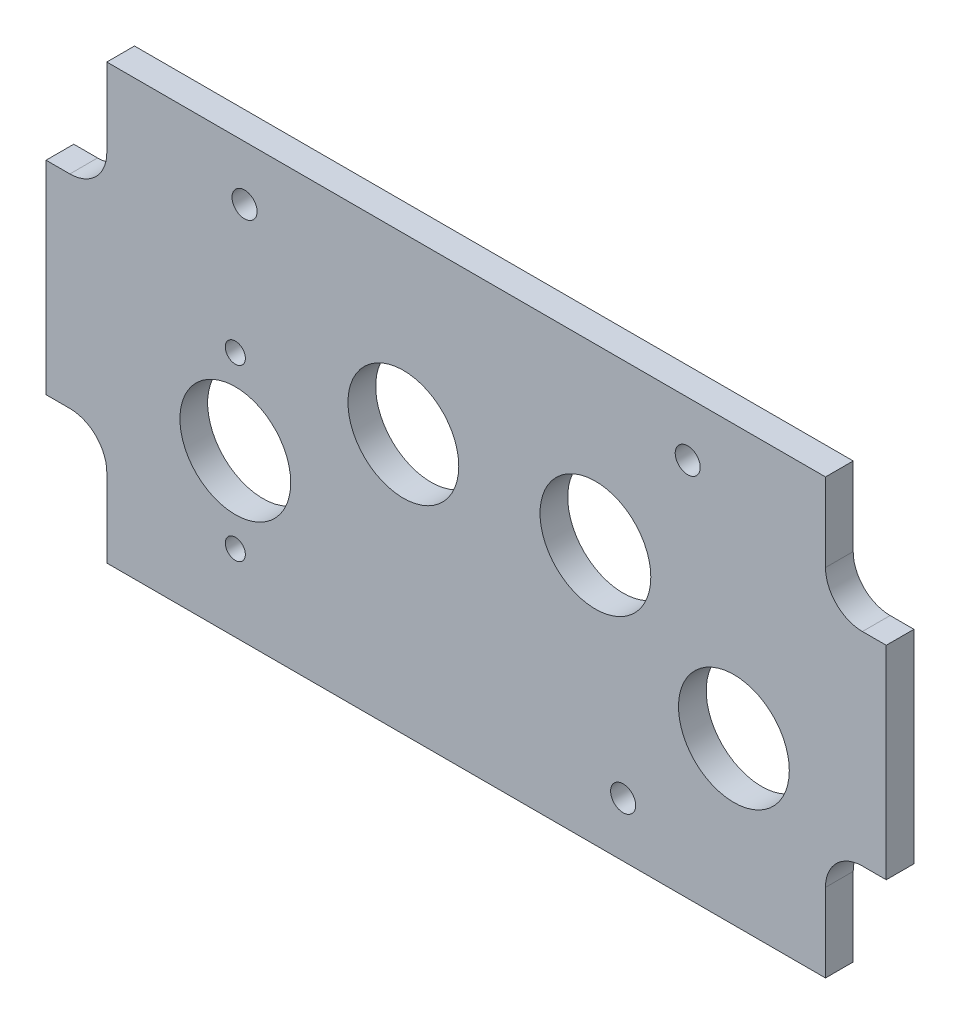
ISO-10303-21;
HEADER;
FILE_DESCRIPTION(('STEP AP214'),'2;1');
FILE_NAME('part.step','',(''),(''),'','','');
FILE_SCHEMA(('AUTOMOTIVE_DESIGN { 1 0 10303 214 1 1 1 1 }'));
ENDSEC;
DATA;
#1=APPLICATION_CONTEXT('core data for automotive mechanical design processes');
#2=APPLICATION_PROTOCOL_DEFINITION('international standard','automotive_design',2000,#1);
#3=PRODUCT_CONTEXT('',#1,'mechanical');
#4=PRODUCT('Part','Part','',(#3));
#5=PRODUCT_RELATED_PRODUCT_CATEGORY('part','',(#4));
#6=PRODUCT_DEFINITION_FORMATION('','',#4);
#7=PRODUCT_DEFINITION_CONTEXT('part definition',#1,'design');
#8=PRODUCT_DEFINITION('design','',#6,#7);
#9=PRODUCT_DEFINITION_SHAPE('','',#8);
#10=(LENGTH_UNIT() NAMED_UNIT(*) SI_UNIT(.MILLI.,.METRE.));
#11=(NAMED_UNIT(*) PLANE_ANGLE_UNIT() SI_UNIT($,.RADIAN.));
#12=(NAMED_UNIT(*) SI_UNIT($,.STERADIAN.) SOLID_ANGLE_UNIT());
#13=UNCERTAINTY_MEASURE_WITH_UNIT(LENGTH_MEASURE(1.E-05),#10,'distance_accuracy_value','');
#14=(GEOMETRIC_REPRESENTATION_CONTEXT(3) GLOBAL_UNCERTAINTY_ASSIGNED_CONTEXT((#13)) GLOBAL_UNIT_ASSIGNED_CONTEXT((#10,
#11,#12)) REPRESENTATION_CONTEXT('',''));
#15=CARTESIAN_POINT('',(0.,0.,0.));
#16=DIRECTION('',(0.,0.,1.));
#17=DIRECTION('',(1.,0.,0.));
#18=AXIS2_PLACEMENT_3D('',#15,#16,#17);
#19=CARTESIAN_POINT('',(4.88950000000002,14.2875,4.7625));
#20=DIRECTION('',(0.,0.,-1.));
#21=DIRECTION('',(-1.,0.,0.));
#22=AXIS2_PLACEMENT_3D('',#19,#20,#21);
#23=CYLINDRICAL_SURFACE('',#22,6.34999999999994);
#24=CARTESIAN_POINT('',(4.88950000000002,14.2875,0.));
#25=DIRECTION('',(0.,0.,-1.));
#26=DIRECTION('',(1.,0.,0.));
#27=AXIS2_PLACEMENT_3D('',#24,#25,#26);
#28=CIRCLE('',#27,6.34999999999994);
#29=CARTESIAN_POINT('',(4.88949999999981,20.6375,0.));
#30=VERTEX_POINT('',#29);
#31=CARTESIAN_POINT('',(11.2395,14.2875,0.));
#32=VERTEX_POINT('',#31);
#33=EDGE_CURVE('E176',#30,#32,#28,.T.);
#34=ORIENTED_EDGE('',*,*,#33,.T.);
#35=DIRECTION('',(0.,0.,-1.));
#36=VECTOR('',#35,1.);
#37=CARTESIAN_POINT('',(11.2395,14.2875,4.7625));
#38=LINE('',#37,#36);
#39=CARTESIAN_POINT('',(11.2395,14.2875,4.7625));
#40=VERTEX_POINT('',#39);
#41=EDGE_CURVE('E11',#40,#32,#38,.T.);
#42=ORIENTED_EDGE('',*,*,#41,.F.);
#43=CARTESIAN_POINT('',(4.88950000000002,14.2875,4.7625));
#44=DIRECTION('',(0.,0.,-1.));
#45=DIRECTION('',(1.,0.,0.));
#46=AXIS2_PLACEMENT_3D('',#43,#44,#45);
#47=CIRCLE('',#46,6.34999999999994);
#48=CARTESIAN_POINT('',(4.88949999999981,20.6375,4.7625));
#49=VERTEX_POINT('',#48);
#50=EDGE_CURVE('E207',#49,#40,#47,.T.);
#51=ORIENTED_EDGE('',*,*,#50,.F.);
#52=DIRECTION('',(0.,0.,-1.));
#53=VECTOR('',#52,1.);
#54=CARTESIAN_POINT('',(4.88949999999981,20.6375,4.7625));
#55=LINE('',#54,#53);
#56=EDGE_CURVE('E172',#49,#30,#55,.T.);
#57=ORIENTED_EDGE('',*,*,#56,.T.);
#58=EDGE_LOOP('',(#34,#42,#51,#57));
#59=FACE_BOUND('',#58,.T.);
#60=ADVANCED_FACE('F32',(#59),#23,.F.);
#61=CARTESIAN_POINT('',(11.2395,14.2875,4.7625));
#62=DIRECTION('',(1.,0.,0.));
#63=DIRECTION('',(0.,0.,-1.));
#64=AXIS2_PLACEMENT_3D('',#61,#62,#63);
#65=PLANE('',#64);
#66=DIRECTION('',(0.,-1.,0.));
#67=VECTOR('',#66,1.);
#68=CARTESIAN_POINT('',(11.2395,14.2875,0.));
#69=LINE('',#68,#67);
#70=CARTESIAN_POINT('',(11.2395,0.793750000000045,0.));
#71=VERTEX_POINT('',#70);
#72=EDGE_CURVE('E179',#32,#71,#69,.T.);
#73=ORIENTED_EDGE('',*,*,#72,.T.);
#74=DIRECTION('',(0.,0.,-1.));
#75=VECTOR('',#74,1.);
#76=CARTESIAN_POINT('',(11.2395,0.793750000000045,4.7625));
#77=LINE('',#76,#75);
#78=CARTESIAN_POINT('',(11.2395,0.793750000000045,4.7625));
#79=VERTEX_POINT('',#78);
#80=EDGE_CURVE('E40',#79,#71,#77,.T.);
#81=ORIENTED_EDGE('',*,*,#80,.F.);
#82=DIRECTION('',(0.,-1.,0.));
#83=VECTOR('',#82,1.);
#84=CARTESIAN_POINT('',(11.2395,14.2875,4.7625));
#85=LINE('',#84,#83);
#86=EDGE_CURVE('E115',#40,#79,#85,.T.);
#87=ORIENTED_EDGE('',*,*,#86,.F.);
#88=ORIENTED_EDGE('',*,*,#41,.T.);
#89=EDGE_LOOP('',(#73,#81,#87,#88));
#90=FACE_BOUND('',#89,.T.);
#91=ADVANCED_FACE('F306',(#90),#65,.F.);
#92=CARTESIAN_POINT('',(11.2395,0.793750000000045,4.7625));
#93=DIRECTION('',(0.,1.,0.));
#94=DIRECTION('',(-1.,0.,0.));
#95=AXIS2_PLACEMENT_3D('',#92,#93,#94);
#96=PLANE('',#95);
#97=DIRECTION('',(1.,0.,0.));
#98=VECTOR('',#97,1.);
#99=CARTESIAN_POINT('',(11.2395,0.793750000000045,0.));
#100=LINE('',#99,#98);
#101=CARTESIAN_POINT('',(134.8105,0.793750000000041,0.));
#102=VERTEX_POINT('',#101);
#103=EDGE_CURVE('E182',#71,#102,#100,.T.);
#104=ORIENTED_EDGE('',*,*,#103,.T.);
#105=DIRECTION('',(0.,0.,-1.));
#106=VECTOR('',#105,1.);
#107=CARTESIAN_POINT('',(134.8105,0.793750000000041,4.7625));
#108=LINE('',#107,#106);
#109=CARTESIAN_POINT('',(134.8105,0.793750000000041,4.7625));
#110=VERTEX_POINT('',#109);
#111=EDGE_CURVE('E238',#110,#102,#108,.T.);
#112=ORIENTED_EDGE('',*,*,#111,.F.);
#113=DIRECTION('',(1.,0.,0.));
#114=VECTOR('',#113,1.);
#115=CARTESIAN_POINT('',(11.2395,0.793750000000045,4.7625));
#116=LINE('',#115,#114);
#117=EDGE_CURVE('E246',#79,#110,#116,.T.);
#118=ORIENTED_EDGE('',*,*,#117,.F.);
#119=ORIENTED_EDGE('',*,*,#80,.T.);
#120=EDGE_LOOP('',(#104,#112,#118,#119));
#121=FACE_BOUND('',#120,.T.);
#122=ADVANCED_FACE('F244',(#121),#96,.F.);
#123=CARTESIAN_POINT('',(134.8105,0.793750000000041,4.7625));
#124=DIRECTION('',(-1.,0.,0.));
#125=DIRECTION('',(0.,-1.,0.));
#126=AXIS2_PLACEMENT_3D('',#123,#124,#125);
#127=PLANE('',#126);
#128=DIRECTION('',(0.,1.,0.));
#129=VECTOR('',#128,1.);
#130=CARTESIAN_POINT('',(134.8105,0.793750000000041,0.));
#131=LINE('',#130,#129);
#132=CARTESIAN_POINT('',(134.8105,14.2875,0.));
#133=VERTEX_POINT('',#132);
#134=EDGE_CURVE('E184',#102,#133,#131,.T.);
#135=ORIENTED_EDGE('',*,*,#134,.T.);
#136=DIRECTION('',(0.,0.,-1.));
#137=VECTOR('',#136,1.);
#138=CARTESIAN_POINT('',(134.8105,14.2875,4.7625));
#139=LINE('',#138,#137);
#140=CARTESIAN_POINT('',(134.8105,14.2875,4.7625));
#141=VERTEX_POINT('',#140);
#142=EDGE_CURVE('E235',#141,#133,#139,.T.);
#143=ORIENTED_EDGE('',*,*,#142,.F.);
#144=DIRECTION('',(0.,1.,0.));
#145=VECTOR('',#144,1.);
#146=CARTESIAN_POINT('',(134.8105,0.793750000000041,4.7625));
#147=LINE('',#146,#145);
#148=EDGE_CURVE('E264',#110,#141,#147,.T.);
#149=ORIENTED_EDGE('',*,*,#148,.F.);
#150=ORIENTED_EDGE('',*,*,#111,.T.);
#151=EDGE_LOOP('',(#135,#143,#149,#150));
#152=FACE_BOUND('',#151,.T.);
#153=ADVANCED_FACE('F255',(#152),#127,.F.);
#154=CARTESIAN_POINT('',(141.1605,14.2875,4.7625));
#155=DIRECTION('',(0.,0.,-1.));
#156=DIRECTION('',(-1.,0.,0.));
#157=AXIS2_PLACEMENT_3D('',#154,#155,#156);
#158=CYLINDRICAL_SURFACE('',#157,6.34999999999997);
#159=CARTESIAN_POINT('',(141.1605,14.2875,0.));
#160=DIRECTION('',(0.,0.,-1.));
#161=DIRECTION('',(1.,0.,0.));
#162=AXIS2_PLACEMENT_3D('',#159,#160,#161);
#163=CIRCLE('',#162,6.34999999999997);
#164=CARTESIAN_POINT('',(141.1605,20.6375,0.));
#165=VERTEX_POINT('',#164);
#166=EDGE_CURVE('E186',#133,#165,#163,.T.);
#167=ORIENTED_EDGE('',*,*,#166,.T.);
#168=DIRECTION('',(0.,0.,-1.));
#169=VECTOR('',#168,1.);
#170=CARTESIAN_POINT('',(141.1605,20.6375,4.7625));
#171=LINE('',#170,#169);
#172=CARTESIAN_POINT('',(141.1605,20.6375,4.7625));
#173=VERTEX_POINT('',#172);
#174=EDGE_CURVE('E232',#173,#165,#171,.T.);
#175=ORIENTED_EDGE('',*,*,#174,.F.);
#176=CARTESIAN_POINT('',(141.1605,14.2875,4.7625));
#177=DIRECTION('',(0.,0.,-1.));
#178=DIRECTION('',(1.,0.,0.));
#179=AXIS2_PLACEMENT_3D('',#176,#177,#178);
#180=CIRCLE('',#179,6.34999999999997);
#181=EDGE_CURVE('E261',#141,#173,#180,.T.);
#182=ORIENTED_EDGE('',*,*,#181,.F.);
#183=ORIENTED_EDGE('',*,*,#142,.T.);
#184=EDGE_LOOP('',(#167,#175,#182,#183));
#185=FACE_BOUND('',#184,.T.);
#186=ADVANCED_FACE('F259',(#185),#158,.F.);
#187=CARTESIAN_POINT('',(141.1605,20.6375,4.7625));
#188=DIRECTION('',(0.,1.,0.));
#189=DIRECTION('',(-1.,0.,0.));
#190=AXIS2_PLACEMENT_3D('',#187,#188,#189);
#191=PLANE('',#190);
#192=DIRECTION('',(1.,0.,0.));
#193=VECTOR('',#192,1.);
#194=CARTESIAN_POINT('',(141.1605,20.6375,0.));
#195=LINE('',#194,#193);
#196=CARTESIAN_POINT('',(145.25625,20.6374999999999,0.));
#197=VERTEX_POINT('',#196);
#198=EDGE_CURVE('E188',#165,#197,#195,.T.);
#199=ORIENTED_EDGE('',*,*,#198,.T.);
#200=DIRECTION('',(0.,0.,-1.));
#201=VECTOR('',#200,1.);
#202=CARTESIAN_POINT('',(145.25625,20.6374999999999,4.7625));
#203=LINE('',#202,#201);
#204=CARTESIAN_POINT('',(145.25625,20.6374999999999,4.7625));
#205=VERTEX_POINT('',#204);
#206=EDGE_CURVE('E229',#205,#197,#203,.T.);
#207=ORIENTED_EDGE('',*,*,#206,.F.);
#208=DIRECTION('',(1.,0.,0.));
#209=VECTOR('',#208,1.);
#210=CARTESIAN_POINT('',(141.1605,20.6375,4.7625));
#211=LINE('',#210,#209);
#212=EDGE_CURVE('E263',#173,#205,#211,.T.);
#213=ORIENTED_EDGE('',*,*,#212,.F.);
#214=ORIENTED_EDGE('',*,*,#174,.T.);
#215=EDGE_LOOP('',(#199,#207,#213,#214));
#216=FACE_BOUND('',#215,.T.);
#217=ADVANCED_FACE('F319',(#216),#191,.F.);
#218=CARTESIAN_POINT('',(145.25625,20.6374999999999,4.7625));
#219=DIRECTION('',(-1.,0.,0.));
#220=DIRECTION('',(0.,0.,1.));
#221=AXIS2_PLACEMENT_3D('',#218,#219,#220);
#222=PLANE('',#221);
#223=DIRECTION('',(0.,1.,0.));
#224=VECTOR('',#223,1.);
#225=CARTESIAN_POINT('',(145.25625,20.6374999999999,0.));
#226=LINE('',#225,#224);
#227=CARTESIAN_POINT('',(145.25625,55.5625000000003,0.));
#228=VERTEX_POINT('',#227);
#229=EDGE_CURVE('E190',#197,#228,#226,.T.);
#230=ORIENTED_EDGE('',*,*,#229,.T.);
#231=DIRECTION('',(0.,0.,-1.));
#232=VECTOR('',#231,1.);
#233=CARTESIAN_POINT('',(145.25625,55.5625000000003,4.7625));
#234=LINE('',#233,#232);
#235=CARTESIAN_POINT('',(145.25625,55.5625000000003,4.7625));
#236=VERTEX_POINT('',#235);
#237=EDGE_CURVE('E226',#236,#228,#234,.T.);
#238=ORIENTED_EDGE('',*,*,#237,.F.);
#239=DIRECTION('',(0.,1.,0.));
#240=VECTOR('',#239,1.);
#241=CARTESIAN_POINT('',(145.25625,20.6374999999999,4.7625));
#242=LINE('',#241,#240);
#243=EDGE_CURVE('E266',#205,#236,#242,.T.);
#244=ORIENTED_EDGE('',*,*,#243,.F.);
#245=ORIENTED_EDGE('',*,*,#206,.T.);
#246=EDGE_LOOP('',(#230,#238,#244,#245));
#247=FACE_BOUND('',#246,.T.);
#248=ADVANCED_FACE('F322',(#247),#222,.F.);
#249=CARTESIAN_POINT('',(145.25625,55.5625000000003,4.7625));
#250=DIRECTION('',(0.,-1.,0.));
#251=DIRECTION('',(1.,0.,0.));
#252=AXIS2_PLACEMENT_3D('',#249,#250,#251);
#253=PLANE('',#252);
#254=DIRECTION('',(-1.,0.,0.));
#255=VECTOR('',#254,1.);
#256=CARTESIAN_POINT('',(145.25625,55.5625000000003,0.));
#257=LINE('',#256,#255);
#258=CARTESIAN_POINT('',(141.1605,55.5625000000001,0.));
#259=VERTEX_POINT('',#258);
#260=EDGE_CURVE('E192',#228,#259,#257,.T.);
#261=ORIENTED_EDGE('',*,*,#260,.T.);
#262=DIRECTION('',(0.,0.,-1.));
#263=VECTOR('',#262,1.);
#264=CARTESIAN_POINT('',(141.1605,55.5625000000001,4.7625));
#265=LINE('',#264,#263);
#266=CARTESIAN_POINT('',(141.1605,55.5625000000001,4.7625));
#267=VERTEX_POINT('',#266);
#268=EDGE_CURVE('E223',#267,#259,#265,.T.);
#269=ORIENTED_EDGE('',*,*,#268,.F.);
#270=DIRECTION('',(-1.,0.,0.));
#271=VECTOR('',#270,1.);
#272=CARTESIAN_POINT('',(145.25625,55.5625000000003,4.7625));
#273=LINE('',#272,#271);
#274=EDGE_CURVE('E272',#236,#267,#273,.T.);
#275=ORIENTED_EDGE('',*,*,#274,.F.);
#276=ORIENTED_EDGE('',*,*,#237,.T.);
#277=EDGE_LOOP('',(#261,#269,#275,#276));
#278=FACE_BOUND('',#277,.T.);
#279=ADVANCED_FACE('F326',(#278),#253,.F.);
#280=CARTESIAN_POINT('',(141.1605,61.9125,4.7625));
#281=DIRECTION('',(0.,0.,-1.));
#282=DIRECTION('',(-1.,0.,0.));
#283=AXIS2_PLACEMENT_3D('',#280,#281,#282);
#284=CYLINDRICAL_SURFACE('',#283,6.34999999999996);
#285=CARTESIAN_POINT('',(141.1605,61.9125,0.));
#286=DIRECTION('',(0.,0.,-1.));
#287=DIRECTION('',(1.,0.,0.));
#288=AXIS2_PLACEMENT_3D('',#285,#286,#287);
#289=CIRCLE('',#288,6.34999999999996);
#290=CARTESIAN_POINT('',(134.8105,61.9125,0.));
#291=VERTEX_POINT('',#290);
#292=EDGE_CURVE('E194',#259,#291,#289,.T.);
#293=ORIENTED_EDGE('',*,*,#292,.T.);
#294=DIRECTION('',(0.,0.,-1.));
#295=VECTOR('',#294,1.);
#296=CARTESIAN_POINT('',(134.8105,61.9125,4.7625));
#297=LINE('',#296,#295);
#298=CARTESIAN_POINT('',(134.8105,61.9125,4.7625));
#299=VERTEX_POINT('',#298);
#300=EDGE_CURVE('E220',#299,#291,#297,.T.);
#301=ORIENTED_EDGE('',*,*,#300,.F.);
#302=CARTESIAN_POINT('',(141.1605,61.9125,4.7625));
#303=DIRECTION('',(0.,0.,-1.));
#304=DIRECTION('',(1.,0.,0.));
#305=AXIS2_PLACEMENT_3D('',#302,#303,#304);
#306=CIRCLE('',#305,6.34999999999996);
#307=EDGE_CURVE('E274',#267,#299,#306,.T.);
#308=ORIENTED_EDGE('',*,*,#307,.F.);
#309=ORIENTED_EDGE('',*,*,#268,.T.);
#310=EDGE_LOOP('',(#293,#301,#308,#309));
#311=FACE_BOUND('',#310,.T.);
#312=ADVANCED_FACE('F330',(#311),#284,.F.);
#313=CARTESIAN_POINT('',(134.8105,61.9125,4.7625));
#314=DIRECTION('',(-1.,0.,0.));
#315=DIRECTION('',(0.,-1.,0.));
#316=AXIS2_PLACEMENT_3D('',#313,#314,#315);
#317=PLANE('',#316);
#318=DIRECTION('',(0.,1.,0.));
#319=VECTOR('',#318,1.);
#320=CARTESIAN_POINT('',(134.8105,61.9125,0.));
#321=LINE('',#320,#319);
#322=CARTESIAN_POINT('',(134.8105,75.40625,0.));
#323=VERTEX_POINT('',#322);
#324=EDGE_CURVE('E196',#291,#323,#321,.T.);
#325=ORIENTED_EDGE('',*,*,#324,.T.);
#326=DIRECTION('',(0.,0.,-1.));
#327=VECTOR('',#326,1.);
#328=CARTESIAN_POINT('',(134.8105,75.40625,4.7625));
#329=LINE('',#328,#327);
#330=CARTESIAN_POINT('',(134.8105,75.40625,4.7625));
#331=VERTEX_POINT('',#330);
#332=EDGE_CURVE('E217',#331,#323,#329,.T.);
#333=ORIENTED_EDGE('',*,*,#332,.F.);
#334=DIRECTION('',(0.,1.,0.));
#335=VECTOR('',#334,1.);
#336=CARTESIAN_POINT('',(134.8105,61.9125,4.7625));
#337=LINE('',#336,#335);
#338=EDGE_CURVE('E276',#299,#331,#337,.T.);
#339=ORIENTED_EDGE('',*,*,#338,.F.);
#340=ORIENTED_EDGE('',*,*,#300,.T.);
#341=EDGE_LOOP('',(#325,#333,#339,#340));
#342=FACE_BOUND('',#341,.T.);
#343=ADVANCED_FACE('F334',(#342),#317,.F.);
#344=CARTESIAN_POINT('',(134.8105,75.40625,4.7625));
#345=DIRECTION('',(0.,-1.,0.));
#346=DIRECTION('',(0.,0.,-1.));
#347=AXIS2_PLACEMENT_3D('',#344,#345,#346);
#348=PLANE('',#347);
#349=DIRECTION('',(-1.,0.,0.));
#350=VECTOR('',#349,1.);
#351=CARTESIAN_POINT('',(134.8105,75.40625,0.));
#352=LINE('',#351,#350);
#353=CARTESIAN_POINT('',(11.2394999999998,75.40625,0.));
#354=VERTEX_POINT('',#353);
#355=EDGE_CURVE('E198',#323,#354,#352,.T.);
#356=ORIENTED_EDGE('',*,*,#355,.T.);
#357=DIRECTION('',(0.,0.,-1.));
#358=VECTOR('',#357,1.);
#359=CARTESIAN_POINT('',(11.2394999999998,75.40625,4.7625));
#360=LINE('',#359,#358);
#361=CARTESIAN_POINT('',(11.2394999999998,75.40625,4.7625));
#362=VERTEX_POINT('',#361);
#363=EDGE_CURVE('E214',#362,#354,#360,.T.);
#364=ORIENTED_EDGE('',*,*,#363,.F.);
#365=DIRECTION('',(-1.,0.,0.));
#366=VECTOR('',#365,1.);
#367=CARTESIAN_POINT('',(134.8105,75.40625,4.7625));
#368=LINE('',#367,#366);
#369=EDGE_CURVE('E278',#331,#362,#368,.T.);
#370=ORIENTED_EDGE('',*,*,#369,.F.);
#371=ORIENTED_EDGE('',*,*,#332,.T.);
#372=EDGE_LOOP('',(#356,#364,#370,#371));
#373=FACE_BOUND('',#372,.T.);
#374=ADVANCED_FACE('F338',(#373),#348,.F.);
#375=CARTESIAN_POINT('',(11.2394999999998,75.40625,4.7625));
#376=DIRECTION('',(1.,0.,0.));
#377=DIRECTION('',(0.,1.,0.));
#378=AXIS2_PLACEMENT_3D('',#375,#376,#377);
#379=PLANE('',#378);
#380=DIRECTION('',(0.,-1.,0.));
#381=VECTOR('',#380,1.);
#382=CARTESIAN_POINT('',(11.2394999999998,75.40625,0.));
#383=LINE('',#382,#381);
#384=CARTESIAN_POINT('',(11.2395,61.9125,0.));
#385=VERTEX_POINT('',#384);
#386=EDGE_CURVE('E200',#354,#385,#383,.T.);
#387=ORIENTED_EDGE('',*,*,#386,.T.);
#388=DIRECTION('',(0.,0.,-1.));
#389=VECTOR('',#388,1.);
#390=CARTESIAN_POINT('',(11.2395,61.9125,4.7625));
#391=LINE('',#390,#389);
#392=CARTESIAN_POINT('',(11.2395,61.9125,4.7625));
#393=VERTEX_POINT('',#392);
#394=EDGE_CURVE('E211',#393,#385,#391,.T.);
#395=ORIENTED_EDGE('',*,*,#394,.F.);
#396=DIRECTION('',(0.,-1.,0.));
#397=VECTOR('',#396,1.);
#398=CARTESIAN_POINT('',(11.2394999999998,75.40625,4.7625));
#399=LINE('',#398,#397);
#400=EDGE_CURVE('E280',#362,#393,#399,.T.);
#401=ORIENTED_EDGE('',*,*,#400,.F.);
#402=ORIENTED_EDGE('',*,*,#363,.T.);
#403=EDGE_LOOP('',(#387,#395,#401,#402));
#404=FACE_BOUND('',#403,.T.);
#405=ADVANCED_FACE('F286',(#404),#379,.F.);
#406=CARTESIAN_POINT('',(4.88950000000002,61.9125,4.7625));
#407=DIRECTION('',(0.,0.,-1.));
#408=DIRECTION('',(-1.,0.,0.));
#409=AXIS2_PLACEMENT_3D('',#406,#407,#408);
#410=CYLINDRICAL_SURFACE('',#409,6.34999999999997);
#411=CARTESIAN_POINT('',(4.88950000000002,61.9125,0.));
#412=DIRECTION('',(0.,0.,-1.));
#413=DIRECTION('',(1.,0.,0.));
#414=AXIS2_PLACEMENT_3D('',#411,#412,#413);
#415=CIRCLE('',#414,6.34999999999997);
#416=CARTESIAN_POINT('',(4.8894999999998,55.5625,0.));
#417=VERTEX_POINT('',#416);
#418=EDGE_CURVE('E202',#385,#417,#415,.T.);
#419=ORIENTED_EDGE('',*,*,#418,.T.);
#420=DIRECTION('',(0.,0.,-1.));
#421=VECTOR('',#420,1.);
#422=CARTESIAN_POINT('',(4.8894999999998,55.5625,4.7625));
#423=LINE('',#422,#421);
#424=CARTESIAN_POINT('',(4.8894999999998,55.5625,4.7625));
#425=VERTEX_POINT('',#424);
#426=EDGE_CURVE('E167',#425,#417,#423,.T.);
#427=ORIENTED_EDGE('',*,*,#426,.F.);
#428=CARTESIAN_POINT('',(4.88950000000002,61.9125,4.7625));
#429=DIRECTION('',(0.,0.,-1.));
#430=DIRECTION('',(1.,0.,0.));
#431=AXIS2_PLACEMENT_3D('',#428,#429,#430);
#432=CIRCLE('',#431,6.34999999999997);
#433=EDGE_CURVE('E158',#393,#425,#432,.T.);
#434=ORIENTED_EDGE('',*,*,#433,.F.);
#435=ORIENTED_EDGE('',*,*,#394,.T.);
#436=EDGE_LOOP('',(#419,#427,#434,#435));
#437=FACE_BOUND('',#436,.T.);
#438=ADVANCED_FACE('F290',(#437),#410,.F.);
#439=CARTESIAN_POINT('',(4.88949999999981,55.5625,4.7625));
#440=DIRECTION('',(0.,-1.,0.));
#441=DIRECTION('',(1.,0.,0.));
#442=AXIS2_PLACEMENT_3D('',#439,#440,#441);
#443=PLANE('',#442);
#444=DIRECTION('',(-1.,0.,0.));
#445=VECTOR('',#444,1.);
#446=CARTESIAN_POINT('',(4.88949999999981,55.5625,0.));
#447=LINE('',#446,#445);
#448=CARTESIAN_POINT('',(0.793749999999986,55.5625000000001,0.));
#449=VERTEX_POINT('',#448);
#450=EDGE_CURVE('E166',#417,#449,#447,.T.);
#451=ORIENTED_EDGE('',*,*,#450,.T.);
#452=DIRECTION('',(0.,0.,-1.));
#453=VECTOR('',#452,1.);
#454=CARTESIAN_POINT('',(0.793749999999986,55.5625000000001,4.7625));
#455=LINE('',#454,#453);
#456=CARTESIAN_POINT('',(0.793749999999986,55.5625000000001,4.7625));
#457=VERTEX_POINT('',#456);
#458=EDGE_CURVE('E163',#457,#449,#455,.T.);
#459=ORIENTED_EDGE('',*,*,#458,.F.);
#460=DIRECTION('',(-1.,0.,0.));
#461=VECTOR('',#460,1.);
#462=CARTESIAN_POINT('',(4.88949999999981,55.5625,4.7625));
#463=LINE('',#462,#461);
#464=EDGE_CURVE('E152',#425,#457,#463,.T.);
#465=ORIENTED_EDGE('',*,*,#464,.F.);
#466=ORIENTED_EDGE('',*,*,#426,.T.);
#467=EDGE_LOOP('',(#451,#459,#465,#466));
#468=FACE_BOUND('',#467,.T.);
#469=ADVANCED_FACE('F164',(#468),#443,.F.);
#470=CARTESIAN_POINT('',(0.793749999999986,55.5625000000001,4.7625));
#471=DIRECTION('',(1.,0.,0.));
#472=DIRECTION('',(0.,1.,0.));
#473=AXIS2_PLACEMENT_3D('',#470,#471,#472);
#474=PLANE('',#473);
#475=DIRECTION('',(0.,-1.,0.));
#476=VECTOR('',#475,1.);
#477=CARTESIAN_POINT('',(0.793749999999986,55.5625000000001,0.));
#478=LINE('',#477,#476);
#479=CARTESIAN_POINT('',(0.79374999999999,20.6374999999998,0.));
#480=VERTEX_POINT('',#479);
#481=EDGE_CURVE('E101',#449,#480,#478,.T.);
#482=ORIENTED_EDGE('',*,*,#481,.T.);
#483=DIRECTION('',(0.,0.,-1.));
#484=VECTOR('',#483,1.);
#485=CARTESIAN_POINT('',(0.79374999999999,20.6374999999998,4.7625));
#486=LINE('',#485,#484);
#487=CARTESIAN_POINT('',(0.79374999999999,20.6374999999998,4.7625));
#488=VERTEX_POINT('',#487);
#489=EDGE_CURVE('E168',#488,#480,#486,.T.);
#490=ORIENTED_EDGE('',*,*,#489,.F.);
#491=DIRECTION('',(0.,-1.,0.));
#492=VECTOR('',#491,1.);
#493=CARTESIAN_POINT('',(0.793749999999986,55.5625000000001,4.7625));
#494=LINE('',#493,#492);
#495=EDGE_CURVE('E156',#457,#488,#494,.T.);
#496=ORIENTED_EDGE('',*,*,#495,.F.);
#497=ORIENTED_EDGE('',*,*,#458,.T.);
#498=EDGE_LOOP('',(#482,#490,#496,#497));
#499=FACE_BOUND('',#498,.T.);
#500=ADVANCED_FACE('F170',(#499),#474,.F.);
#501=CARTESIAN_POINT('',(0.79374999999999,20.6374999999998,4.7625));
#502=DIRECTION('',(0.,1.,0.));
#503=DIRECTION('',(-1.,0.,0.));
#504=AXIS2_PLACEMENT_3D('',#501,#502,#503);
#505=PLANE('',#504);
#506=DIRECTION('',(1.,0.,0.));
#507=VECTOR('',#506,1.);
#508=CARTESIAN_POINT('',(0.79374999999999,20.6374999999998,0.));
#509=LINE('',#508,#507);
#510=EDGE_CURVE('E107',#480,#30,#509,.T.);
#511=ORIENTED_EDGE('',*,*,#510,.T.);
#512=ORIENTED_EDGE('',*,*,#56,.F.);
#513=DIRECTION('',(1.,0.,0.));
#514=VECTOR('',#513,1.);
#515=CARTESIAN_POINT('',(0.79374999999999,20.6374999999998,4.7625));
#516=LINE('',#515,#514);
#517=EDGE_CURVE('E48',#488,#49,#516,.T.);
#518=ORIENTED_EDGE('',*,*,#517,.F.);
#519=ORIENTED_EDGE('',*,*,#489,.T.);
#520=EDGE_LOOP('',(#511,#512,#518,#519));
#521=FACE_BOUND('',#520,.T.);
#522=ADVANCED_FACE('F294',(#521),#505,.F.);
#523=CARTESIAN_POINT('',(4.88950000000002,14.2875,4.7625));
#524=DIRECTION('',(0.,0.,1.));
#525=DIRECTION('',(1.,0.,0.));
#526=AXIS2_PLACEMENT_3D('',#523,#524,#525);
#527=PLANE('',#526);
#528=CARTESIAN_POINT('',(119.0625,28.575,4.7625));
#529=DIRECTION('',(0.,0.,1.));
#530=DIRECTION('',(1.,0.,0.));
#531=AXIS2_PLACEMENT_3D('',#528,#529,#530);
#532=CIRCLE('',#531,9.52499999999999);
#533=CARTESIAN_POINT('',(128.5875,28.575,4.7625));
#534=VERTEX_POINT('',#533);
#535=EDGE_CURVE('E474',#534,#534,#532,.T.);
#536=ORIENTED_EDGE('',*,*,#535,.F.);
#537=EDGE_LOOP('',(#536));
#538=FACE_BOUND('',#537,.T.);
#539=CARTESIAN_POINT('',(95.25,45.466,4.7625));
#540=DIRECTION('',(0.,0.,1.));
#541=DIRECTION('',(1.,0.,0.));
#542=AXIS2_PLACEMENT_3D('',#539,#540,#541);
#543=CIRCLE('',#542,9.52500000000001);
#544=CARTESIAN_POINT('',(104.775,45.466,4.7625));
#545=VERTEX_POINT('',#544);
#546=EDGE_CURVE('E476',#545,#545,#543,.T.);
#547=ORIENTED_EDGE('',*,*,#546,.F.);
#548=EDGE_LOOP('',(#547));
#549=FACE_BOUND('',#548,.T.);
#550=CARTESIAN_POINT('',(62.23,45.466,4.7625));
#551=DIRECTION('',(0.,0.,1.));
#552=DIRECTION('',(1.,0.,0.));
#553=AXIS2_PLACEMENT_3D('',#550,#551,#552);
#554=CIRCLE('',#553,9.525);
#555=CARTESIAN_POINT('',(71.755,45.466,4.7625));
#556=VERTEX_POINT('',#555);
#557=EDGE_CURVE('E484',#556,#556,#554,.T.);
#558=ORIENTED_EDGE('',*,*,#557,.F.);
#559=EDGE_LOOP('',(#558));
#560=FACE_BOUND('',#559,.T.);
#561=CARTESIAN_POINT('',(33.3375,28.575,4.7625));
#562=DIRECTION('',(0.,0.,1.));
#563=DIRECTION('',(1.,0.,0.));
#564=AXIS2_PLACEMENT_3D('',#561,#562,#563);
#565=CIRCLE('',#564,9.525);
#566=CARTESIAN_POINT('',(42.8625,28.575,4.7625));
#567=VERTEX_POINT('',#566);
#568=EDGE_CURVE('E490',#567,#567,#565,.T.);
#569=ORIENTED_EDGE('',*,*,#568,.F.);
#570=EDGE_LOOP('',(#569));
#571=FACE_BOUND('',#570,.T.);
#572=CARTESIAN_POINT('',(34.925,66.04,4.7625));
#573=DIRECTION('',(0.,0.,1.));
#574=DIRECTION('',(1.,0.,0.));
#575=AXIS2_PLACEMENT_3D('',#572,#573,#574);
#576=CIRCLE('',#575,2.15265);
#577=CARTESIAN_POINT('',(37.07765,66.04,4.7625));
#578=VERTEX_POINT('',#577);
#579=EDGE_CURVE('E496',#578,#578,#576,.T.);
#580=ORIENTED_EDGE('',*,*,#579,.F.);
#581=EDGE_LOOP('',(#580));
#582=FACE_BOUND('',#581,.T.);
#583=CARTESIAN_POINT('',(111.125,66.04,4.7625));
#584=DIRECTION('',(0.,0.,1.));
#585=DIRECTION('',(1.,0.,0.));
#586=AXIS2_PLACEMENT_3D('',#583,#584,#585);
#587=CIRCLE('',#586,2.15265000000001);
#588=CARTESIAN_POINT('',(113.27765,66.04,4.7625));
#589=VERTEX_POINT('',#588);
#590=EDGE_CURVE('E502',#589,#589,#587,.T.);
#591=ORIENTED_EDGE('',*,*,#590,.F.);
#592=EDGE_LOOP('',(#591));
#593=FACE_BOUND('',#592,.T.);
#594=CARTESIAN_POINT('',(100.01504,10.16,4.7625));
#595=DIRECTION('',(0.,0.,1.));
#596=DIRECTION('',(1.,0.,0.));
#597=AXIS2_PLACEMENT_3D('',#594,#595,#596);
#598=CIRCLE('',#597,2.15265000000001);
#599=CARTESIAN_POINT('',(102.16769,10.16,4.7625));
#600=VERTEX_POINT('',#599);
#601=EDGE_CURVE('E508',#600,#600,#598,.T.);
#602=ORIENTED_EDGE('',*,*,#601,.F.);
#603=EDGE_LOOP('',(#602));
#604=FACE_BOUND('',#603,.T.);
#605=CARTESIAN_POINT('',(33.3375,43.18,4.7625));
#606=DIRECTION('',(0.,0.,1.));
#607=DIRECTION('',(1.,0.,0.));
#608=AXIS2_PLACEMENT_3D('',#605,#606,#607);
#609=CIRCLE('',#608,1.72719999999999);
#610=CARTESIAN_POINT('',(35.0647,43.18,4.7625));
#611=VERTEX_POINT('',#610);
#612=EDGE_CURVE('E514',#611,#611,#609,.T.);
#613=ORIENTED_EDGE('',*,*,#612,.F.);
#614=EDGE_LOOP('',(#613));
#615=FACE_BOUND('',#614,.T.);
#616=CARTESIAN_POINT('',(33.3375,13.97,4.7625));
#617=DIRECTION('',(0.,0.,1.));
#618=DIRECTION('',(1.,0.,0.));
#619=AXIS2_PLACEMENT_3D('',#616,#617,#618);
#620=CIRCLE('',#619,1.72719999999999);
#621=CARTESIAN_POINT('',(35.0647,13.97,4.7625));
#622=VERTEX_POINT('',#621);
#623=EDGE_CURVE('E520',#622,#622,#620,.T.);
#624=ORIENTED_EDGE('',*,*,#623,.F.);
#625=EDGE_LOOP('',(#624));
#626=FACE_BOUND('',#625,.T.);
#627=ORIENTED_EDGE('',*,*,#50,.T.);
#628=ORIENTED_EDGE('',*,*,#86,.T.);
#629=ORIENTED_EDGE('',*,*,#117,.T.);
#630=ORIENTED_EDGE('',*,*,#148,.T.);
#631=ORIENTED_EDGE('',*,*,#181,.T.);
#632=ORIENTED_EDGE('',*,*,#212,.T.);
#633=ORIENTED_EDGE('',*,*,#243,.T.);
#634=ORIENTED_EDGE('',*,*,#274,.T.);
#635=ORIENTED_EDGE('',*,*,#307,.T.);
#636=ORIENTED_EDGE('',*,*,#338,.T.);
#637=ORIENTED_EDGE('',*,*,#369,.T.);
#638=ORIENTED_EDGE('',*,*,#400,.T.);
#639=ORIENTED_EDGE('',*,*,#433,.T.);
#640=ORIENTED_EDGE('',*,*,#464,.T.);
#641=ORIENTED_EDGE('',*,*,#495,.T.);
#642=ORIENTED_EDGE('',*,*,#517,.T.);
#643=EDGE_LOOP('',(#627,#628,#629,#630,#631,#632,#633,#634,#635,#636,#637,#638,#639,#640,#641,#642));
#644=FACE_BOUND('',#643,.T.);
#645=ADVANCED_FACE('F154',(#538,#549,#560,#571,#582,#593,#604,#615,#626,#644),#527,.T.);
#646=CARTESIAN_POINT('',(4.88950000000002,14.2875,0.));
#647=DIRECTION('',(0.,0.,1.));
#648=DIRECTION('',(1.,0.,0.));
#649=AXIS2_PLACEMENT_3D('',#646,#647,#648);
#650=PLANE('',#649);
#651=CARTESIAN_POINT('',(119.0625,28.575,0.));
#652=DIRECTION('',(0.,0.,1.));
#653=DIRECTION('',(1.,0.,0.));
#654=AXIS2_PLACEMENT_3D('',#651,#652,#653);
#655=CIRCLE('',#654,9.52499999999999);
#656=CARTESIAN_POINT('',(128.5875,28.575,0.));
#657=VERTEX_POINT('',#656);
#658=EDGE_CURVE('E471',#657,#657,#655,.T.);
#659=ORIENTED_EDGE('',*,*,#658,.T.);
#660=EDGE_LOOP('',(#659));
#661=FACE_BOUND('',#660,.T.);
#662=CARTESIAN_POINT('',(95.25,45.466,0.));
#663=DIRECTION('',(0.,0.,1.));
#664=DIRECTION('',(1.,0.,0.));
#665=AXIS2_PLACEMENT_3D('',#662,#663,#664);
#666=CIRCLE('',#665,9.52500000000001);
#667=CARTESIAN_POINT('',(104.775,45.466,0.));
#668=VERTEX_POINT('',#667);
#669=EDGE_CURVE('E481',#668,#668,#666,.T.);
#670=ORIENTED_EDGE('',*,*,#669,.T.);
#671=EDGE_LOOP('',(#670));
#672=FACE_BOUND('',#671,.T.);
#673=CARTESIAN_POINT('',(62.23,45.466,0.));
#674=DIRECTION('',(0.,0.,1.));
#675=DIRECTION('',(1.,0.,0.));
#676=AXIS2_PLACEMENT_3D('',#673,#674,#675);
#677=CIRCLE('',#676,9.525);
#678=CARTESIAN_POINT('',(71.755,45.466,0.));
#679=VERTEX_POINT('',#678);
#680=EDGE_CURVE('E487',#679,#679,#677,.T.);
#681=ORIENTED_EDGE('',*,*,#680,.T.);
#682=EDGE_LOOP('',(#681));
#683=FACE_BOUND('',#682,.T.);
#684=CARTESIAN_POINT('',(33.3375,28.575,0.));
#685=DIRECTION('',(0.,0.,1.));
#686=DIRECTION('',(1.,0.,0.));
#687=AXIS2_PLACEMENT_3D('',#684,#685,#686);
#688=CIRCLE('',#687,9.525);
#689=CARTESIAN_POINT('',(42.8625,28.575,0.));
#690=VERTEX_POINT('',#689);
#691=EDGE_CURVE('E493',#690,#690,#688,.T.);
#692=ORIENTED_EDGE('',*,*,#691,.T.);
#693=EDGE_LOOP('',(#692));
#694=FACE_BOUND('',#693,.T.);
#695=CARTESIAN_POINT('',(34.925,66.04,0.));
#696=DIRECTION('',(0.,0.,1.));
#697=DIRECTION('',(1.,0.,0.));
#698=AXIS2_PLACEMENT_3D('',#695,#696,#697);
#699=CIRCLE('',#698,2.15265);
#700=CARTESIAN_POINT('',(37.07765,66.04,0.));
#701=VERTEX_POINT('',#700);
#702=EDGE_CURVE('E499',#701,#701,#699,.T.);
#703=ORIENTED_EDGE('',*,*,#702,.T.);
#704=EDGE_LOOP('',(#703));
#705=FACE_BOUND('',#704,.T.);
#706=CARTESIAN_POINT('',(111.125,66.04,0.));
#707=DIRECTION('',(0.,0.,1.));
#708=DIRECTION('',(1.,0.,0.));
#709=AXIS2_PLACEMENT_3D('',#706,#707,#708);
#710=CIRCLE('',#709,2.15265000000001);
#711=CARTESIAN_POINT('',(113.27765,66.04,0.));
#712=VERTEX_POINT('',#711);
#713=EDGE_CURVE('E505',#712,#712,#710,.T.);
#714=ORIENTED_EDGE('',*,*,#713,.T.);
#715=EDGE_LOOP('',(#714));
#716=FACE_BOUND('',#715,.T.);
#717=CARTESIAN_POINT('',(100.01504,10.16,0.));
#718=DIRECTION('',(0.,0.,1.));
#719=DIRECTION('',(1.,0.,0.));
#720=AXIS2_PLACEMENT_3D('',#717,#718,#719);
#721=CIRCLE('',#720,2.15265000000001);
#722=CARTESIAN_POINT('',(102.16769,10.16,0.));
#723=VERTEX_POINT('',#722);
#724=EDGE_CURVE('E511',#723,#723,#721,.T.);
#725=ORIENTED_EDGE('',*,*,#724,.T.);
#726=EDGE_LOOP('',(#725));
#727=FACE_BOUND('',#726,.T.);
#728=CARTESIAN_POINT('',(33.3375,43.18,0.));
#729=DIRECTION('',(0.,0.,1.));
#730=DIRECTION('',(1.,0.,0.));
#731=AXIS2_PLACEMENT_3D('',#728,#729,#730);
#732=CIRCLE('',#731,1.7272);
#733=CARTESIAN_POINT('',(35.0647,43.18,0.));
#734=VERTEX_POINT('',#733);
#735=EDGE_CURVE('E517',#734,#734,#732,.T.);
#736=ORIENTED_EDGE('',*,*,#735,.T.);
#737=EDGE_LOOP('',(#736));
#738=FACE_BOUND('',#737,.T.);
#739=CARTESIAN_POINT('',(33.3375,13.97,0.));
#740=DIRECTION('',(0.,0.,1.));
#741=DIRECTION('',(1.,0.,0.));
#742=AXIS2_PLACEMENT_3D('',#739,#740,#741);
#743=CIRCLE('',#742,1.7272);
#744=CARTESIAN_POINT('',(35.0647,13.97,0.));
#745=VERTEX_POINT('',#744);
#746=EDGE_CURVE('E180',#745,#745,#743,.T.);
#747=ORIENTED_EDGE('',*,*,#746,.T.);
#748=EDGE_LOOP('',(#747));
#749=FACE_BOUND('',#748,.T.);
#750=ORIENTED_EDGE('',*,*,#33,.F.);
#751=ORIENTED_EDGE('',*,*,#510,.F.);
#752=ORIENTED_EDGE('',*,*,#481,.F.);
#753=ORIENTED_EDGE('',*,*,#450,.F.);
#754=ORIENTED_EDGE('',*,*,#418,.F.);
#755=ORIENTED_EDGE('',*,*,#386,.F.);
#756=ORIENTED_EDGE('',*,*,#355,.F.);
#757=ORIENTED_EDGE('',*,*,#324,.F.);
#758=ORIENTED_EDGE('',*,*,#292,.F.);
#759=ORIENTED_EDGE('',*,*,#260,.F.);
#760=ORIENTED_EDGE('',*,*,#229,.F.);
#761=ORIENTED_EDGE('',*,*,#198,.F.);
#762=ORIENTED_EDGE('',*,*,#166,.F.);
#763=ORIENTED_EDGE('',*,*,#134,.F.);
#764=ORIENTED_EDGE('',*,*,#103,.F.);
#765=ORIENTED_EDGE('',*,*,#72,.F.);
#766=EDGE_LOOP('',(#750,#751,#752,#753,#754,#755,#756,#757,#758,#759,#760,#761,#762,#763,#764,#765));
#767=FACE_BOUND('',#766,.T.);
#768=ADVANCED_FACE('F250',(#661,#672,#683,#694,#705,#716,#727,#738,#749,#767),#650,.F.);
#769=CARTESIAN_POINT('',(33.3375,13.97,4.7625));
#770=DIRECTION('',(0.,0.,1.));
#771=DIRECTION('',(1.,0.,0.));
#772=AXIS2_PLACEMENT_3D('',#769,#770,#771);
#773=CYLINDRICAL_SURFACE('',#772,1.72719999999999);
#774=ORIENTED_EDGE('',*,*,#746,.F.);
#775=EDGE_LOOP('',(#774));
#776=FACE_BOUND('',#775,.T.);
#777=ORIENTED_EDGE('',*,*,#623,.T.);
#778=EDGE_LOOP('',(#777));
#779=FACE_BOUND('',#778,.T.);
#780=ADVANCED_FACE('F366',(#776,#779),#773,.F.);
#781=CARTESIAN_POINT('',(33.3375,43.18,4.7625));
#782=DIRECTION('',(0.,0.,1.));
#783=DIRECTION('',(1.,0.,0.));
#784=AXIS2_PLACEMENT_3D('',#781,#782,#783);
#785=CYLINDRICAL_SURFACE('',#784,1.72719999999999);
#786=ORIENTED_EDGE('',*,*,#735,.F.);
#787=EDGE_LOOP('',(#786));
#788=FACE_BOUND('',#787,.T.);
#789=ORIENTED_EDGE('',*,*,#612,.T.);
#790=EDGE_LOOP('',(#789));
#791=FACE_BOUND('',#790,.T.);
#792=ADVANCED_FACE('F371',(#788,#791),#785,.F.);
#793=CARTESIAN_POINT('',(100.01504,10.16,4.7625));
#794=DIRECTION('',(0.,0.,1.));
#795=DIRECTION('',(1.,0.,0.));
#796=AXIS2_PLACEMENT_3D('',#793,#794,#795);
#797=CYLINDRICAL_SURFACE('',#796,2.15265000000001);
#798=ORIENTED_EDGE('',*,*,#724,.F.);
#799=EDGE_LOOP('',(#798));
#800=FACE_BOUND('',#799,.T.);
#801=ORIENTED_EDGE('',*,*,#601,.T.);
#802=EDGE_LOOP('',(#801));
#803=FACE_BOUND('',#802,.T.);
#804=ADVANCED_FACE('F383',(#800,#803),#797,.F.);
#805=CARTESIAN_POINT('',(111.125,66.04,4.7625));
#806=DIRECTION('',(0.,0.,1.));
#807=DIRECTION('',(1.,0.,0.));
#808=AXIS2_PLACEMENT_3D('',#805,#806,#807);
#809=CYLINDRICAL_SURFACE('',#808,2.15265000000001);
#810=ORIENTED_EDGE('',*,*,#713,.F.);
#811=EDGE_LOOP('',(#810));
#812=FACE_BOUND('',#811,.T.);
#813=ORIENTED_EDGE('',*,*,#590,.T.);
#814=EDGE_LOOP('',(#813));
#815=FACE_BOUND('',#814,.T.);
#816=ADVANCED_FACE('F393',(#812,#815),#809,.F.);
#817=CARTESIAN_POINT('',(34.925,66.04,4.7625));
#818=DIRECTION('',(0.,0.,1.));
#819=DIRECTION('',(1.,0.,0.));
#820=AXIS2_PLACEMENT_3D('',#817,#818,#819);
#821=CYLINDRICAL_SURFACE('',#820,2.15265);
#822=ORIENTED_EDGE('',*,*,#702,.F.);
#823=EDGE_LOOP('',(#822));
#824=FACE_BOUND('',#823,.T.);
#825=ORIENTED_EDGE('',*,*,#579,.T.);
#826=EDGE_LOOP('',(#825));
#827=FACE_BOUND('',#826,.T.);
#828=ADVANCED_FACE('F403',(#824,#827),#821,.F.);
#829=CARTESIAN_POINT('',(33.3375,28.575,4.7625));
#830=DIRECTION('',(0.,0.,1.));
#831=DIRECTION('',(1.,0.,0.));
#832=AXIS2_PLACEMENT_3D('',#829,#830,#831);
#833=CYLINDRICAL_SURFACE('',#832,9.525);
#834=ORIENTED_EDGE('',*,*,#691,.F.);
#835=EDGE_LOOP('',(#834));
#836=FACE_BOUND('',#835,.T.);
#837=ORIENTED_EDGE('',*,*,#568,.T.);
#838=EDGE_LOOP('',(#837));
#839=FACE_BOUND('',#838,.T.);
#840=ADVANCED_FACE('F413',(#836,#839),#833,.F.);
#841=CARTESIAN_POINT('',(62.23,45.466,4.7625));
#842=DIRECTION('',(0.,0.,1.));
#843=DIRECTION('',(1.,0.,0.));
#844=AXIS2_PLACEMENT_3D('',#841,#842,#843);
#845=CYLINDRICAL_SURFACE('',#844,9.525);
#846=ORIENTED_EDGE('',*,*,#680,.F.);
#847=EDGE_LOOP('',(#846));
#848=FACE_BOUND('',#847,.T.);
#849=ORIENTED_EDGE('',*,*,#557,.T.);
#850=EDGE_LOOP('',(#849));
#851=FACE_BOUND('',#850,.T.);
#852=ADVANCED_FACE('F434',(#848,#851),#845,.F.);
#853=CARTESIAN_POINT('',(95.25,45.466,4.7625));
#854=DIRECTION('',(0.,0.,1.));
#855=DIRECTION('',(1.,0.,0.));
#856=AXIS2_PLACEMENT_3D('',#853,#854,#855);
#857=CYLINDRICAL_SURFACE('',#856,9.52500000000001);
#858=ORIENTED_EDGE('',*,*,#669,.F.);
#859=EDGE_LOOP('',(#858));
#860=FACE_BOUND('',#859,.T.);
#861=ORIENTED_EDGE('',*,*,#546,.T.);
#862=EDGE_LOOP('',(#861));
#863=FACE_BOUND('',#862,.T.);
#864=ADVANCED_FACE('F444',(#860,#863),#857,.F.);
#865=CARTESIAN_POINT('',(119.0625,28.575,4.7625));
#866=DIRECTION('',(0.,0.,1.));
#867=DIRECTION('',(1.,0.,0.));
#868=AXIS2_PLACEMENT_3D('',#865,#866,#867);
#869=CYLINDRICAL_SURFACE('',#868,9.52499999999999);
#870=ORIENTED_EDGE('',*,*,#658,.F.);
#871=EDGE_LOOP('',(#870));
#872=FACE_BOUND('',#871,.T.);
#873=ORIENTED_EDGE('',*,*,#535,.T.);
#874=EDGE_LOOP('',(#873));
#875=FACE_BOUND('',#874,.T.);
#876=ADVANCED_FACE('F454',(#872,#875),#869,.F.);
#877=CLOSED_SHELL('',(#60,#91,#122,#153,#186,#217,#248,#279,#312,#343,#374,#405,#438,#469,#500,
#522,#645,#768,#780,#792,#804,#816,#828,#840,#852,#864,#876));
#878=MANIFOLD_SOLID_BREP('B2',#877);
#879=ADVANCED_BREP_SHAPE_REPRESENTATION('',(#18,#878),#14);
#880=SHAPE_DEFINITION_REPRESENTATION(#9,#879);
ENDSEC;
END-ISO-10303-21;
